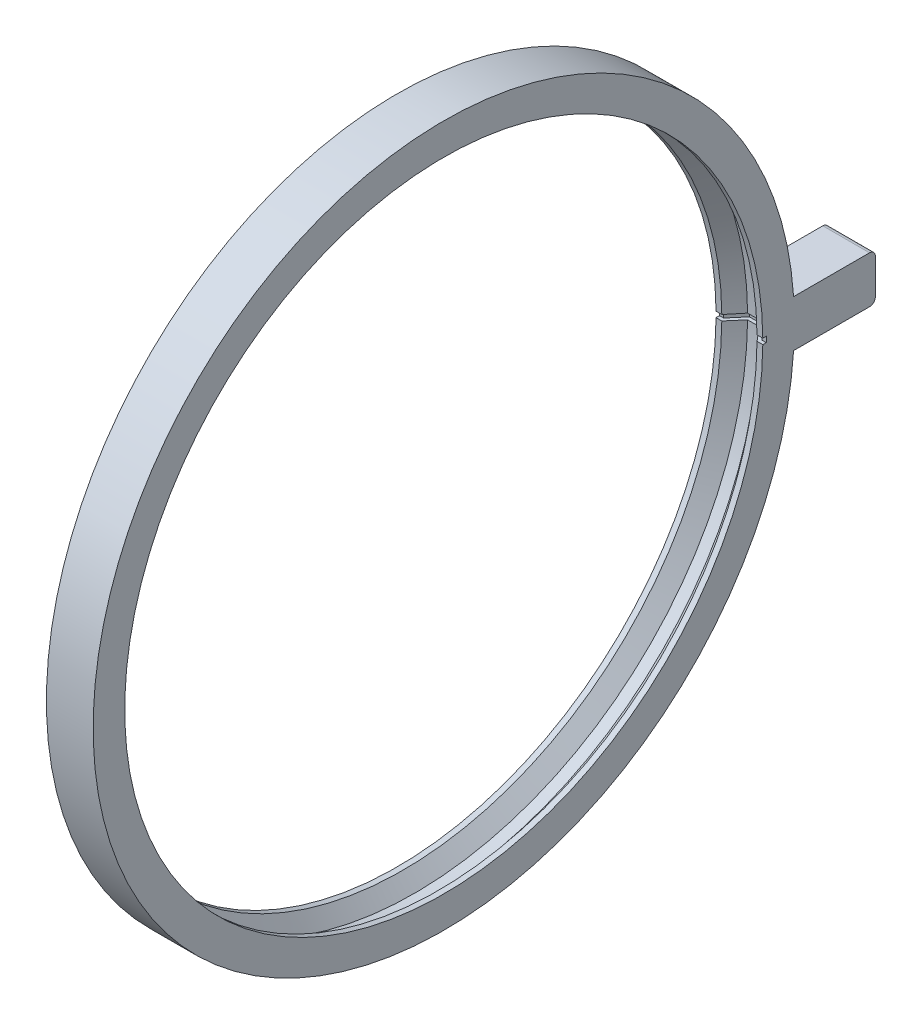
ISO-10303-21;
HEADER;
FILE_DESCRIPTION(('STEP AP214'),'2;1');
FILE_NAME('part.step','',(''),(''),'','','');
FILE_SCHEMA(('AUTOMOTIVE_DESIGN { 1 0 10303 214 1 1 1 1 }'));
ENDSEC;
DATA;
#1=APPLICATION_CONTEXT('core data for automotive mechanical design processes');
#2=APPLICATION_PROTOCOL_DEFINITION('international standard','automotive_design',2000,#1);
#3=PRODUCT_CONTEXT('',#1,'mechanical');
#4=PRODUCT('Part','Part','',(#3));
#5=PRODUCT_RELATED_PRODUCT_CATEGORY('part','',(#4));
#6=PRODUCT_DEFINITION_FORMATION('','',#4);
#7=PRODUCT_DEFINITION_CONTEXT('part definition',#1,'design');
#8=PRODUCT_DEFINITION('design','',#6,#7);
#9=PRODUCT_DEFINITION_SHAPE('','',#8);
#10=(LENGTH_UNIT() NAMED_UNIT(*) SI_UNIT(.MILLI.,.METRE.));
#11=(NAMED_UNIT(*) PLANE_ANGLE_UNIT() SI_UNIT($,.RADIAN.));
#12=(NAMED_UNIT(*) SI_UNIT($,.STERADIAN.) SOLID_ANGLE_UNIT());
#13=UNCERTAINTY_MEASURE_WITH_UNIT(LENGTH_MEASURE(1.E-05),#10,'distance_accuracy_value','');
#14=(GEOMETRIC_REPRESENTATION_CONTEXT(3) GLOBAL_UNCERTAINTY_ASSIGNED_CONTEXT((#13)) GLOBAL_UNIT_ASSIGNED_CONTEXT((#10,
#11,#12)) REPRESENTATION_CONTEXT('',''));
#15=CARTESIAN_POINT('',(0.,0.,0.));
#16=DIRECTION('',(0.,0.,1.));
#17=DIRECTION('',(1.,0.,0.));
#18=AXIS2_PLACEMENT_3D('',#15,#16,#17);
#19=CARTESIAN_POINT('',(0.,0.,0.));
#20=DIRECTION('',(-1.,0.,0.));
#21=DIRECTION('',(0.,0.,1.));
#22=AXIS2_PLACEMENT_3D('',#19,#20,#21);
#23=CYLINDRICAL_SURFACE('',#22,30.);
#24=DIRECTION('',(-1.,0.,0.));
#25=VECTOR('',#24,1.);
#26=CARTESIAN_POINT('',(2.,2.,-29.9332590941915));
#27=LINE('',#26,#25);
#28=CARTESIAN_POINT('',(2.,2.,-29.9332590941915));
#29=VERTEX_POINT('',#28);
#30=CARTESIAN_POINT('',(-2.,2.,-29.9332590941915));
#31=VERTEX_POINT('',#30);
#32=EDGE_CURVE('E258',#29,#31,#27,.T.);
#33=ORIENTED_EDGE('',*,*,#32,.T.);
#34=CARTESIAN_POINT('',(-2.,0.,0.));
#35=DIRECTION('',(-1.,0.,0.));
#36=DIRECTION('',(0.,0.,1.));
#37=AXIS2_PLACEMENT_3D('',#34,#35,#36);
#38=CIRCLE('',#37,30.);
#39=CARTESIAN_POINT('',(-2.,-2.,-29.9332590941915));
#40=VERTEX_POINT('',#39);
#41=EDGE_CURVE('E281',#40,#31,#38,.T.);
#42=ORIENTED_EDGE('',*,*,#41,.F.);
#43=DIRECTION('',(-1.,0.,0.));
#44=VECTOR('',#43,1.);
#45=CARTESIAN_POINT('',(2.,-2.,-29.9332590941915));
#46=LINE('',#45,#44);
#47=CARTESIAN_POINT('',(2.,-2.,-29.9332590941915));
#48=VERTEX_POINT('',#47);
#49=EDGE_CURVE('E250',#48,#40,#46,.T.);
#50=ORIENTED_EDGE('',*,*,#49,.F.);
#51=CARTESIAN_POINT('',(2.,0.,0.));
#52=DIRECTION('',(-1.,0.,0.));
#53=DIRECTION('',(0.,0.,1.));
#54=AXIS2_PLACEMENT_3D('',#51,#52,#53);
#55=CIRCLE('',#54,30.);
#56=EDGE_CURVE('E264',#48,#29,#55,.T.);
#57=ORIENTED_EDGE('',*,*,#56,.T.);
#58=EDGE_LOOP('',(#33,#42,#50,#57));
#59=FACE_BOUND('',#58,.T.);
#60=ADVANCED_FACE('F43',(#59),#23,.T.);
#61=CARTESIAN_POINT('',(0.,0.,0.));
#62=DIRECTION('',(-1.,0.,0.));
#63=DIRECTION('',(0.,0.,1.));
#64=AXIS2_PLACEMENT_3D('',#61,#62,#63);
#65=CYLINDRICAL_SURFACE('',#64,28.5);
#66=DIRECTION('',(1.,0.,0.));
#67=VECTOR('',#66,1.);
#68=CARTESIAN_POINT('',(-0.5,0.248706261703658,-28.4989148073289));
#69=LINE('',#68,#67);
#70=CARTESIAN_POINT('',(-0.5,0.248706261703658,-28.4989148073289));
#71=VERTEX_POINT('',#70);
#72=CARTESIAN_POINT('',(0.5,0.248706261703658,-28.4989148073289));
#73=VERTEX_POINT('',#72);
#74=EDGE_CURVE('E228',#71,#73,#69,.T.);
#75=ORIENTED_EDGE('',*,*,#74,.T.);
#76=CARTESIAN_POINT('',(0.499999999999997,0.,0.));
#77=DIRECTION('',(-1.,0.,0.));
#78=DIRECTION('',(0.,0.,1.));
#79=AXIS2_PLACEMENT_3D('',#76,#77,#78);
#80=CIRCLE('',#79,28.5);
#81=CARTESIAN_POINT('',(0.5,-0.248706261703658,-28.4989148073289));
#82=VERTEX_POINT('',#81);
#83=EDGE_CURVE('E261',#82,#73,#80,.T.);
#84=ORIENTED_EDGE('',*,*,#83,.F.);
#85=DIRECTION('',(1.,0.,0.));
#86=VECTOR('',#85,1.);
#87=CARTESIAN_POINT('',(-0.5,-0.248706261703658,-28.4989148073289));
#88=LINE('',#87,#86);
#89=CARTESIAN_POINT('',(-0.5,-0.248706261703658,-28.4989148073289));
#90=VERTEX_POINT('',#89);
#91=EDGE_CURVE('E209',#90,#82,#88,.T.);
#92=ORIENTED_EDGE('',*,*,#91,.F.);
#93=CARTESIAN_POINT('',(-0.499999999999997,0.,0.));
#94=DIRECTION('',(-1.,0.,0.));
#95=DIRECTION('',(0.,0.,1.));
#96=AXIS2_PLACEMENT_3D('',#93,#94,#95);
#97=CIRCLE('',#96,28.5);
#98=EDGE_CURVE('E272',#90,#71,#97,.T.);
#99=ORIENTED_EDGE('',*,*,#98,.T.);
#100=EDGE_LOOP('',(#75,#84,#92,#99));
#101=FACE_BOUND('',#100,.T.);
#102=ADVANCED_FACE('F324',(#101),#65,.F.);
#103=CARTESIAN_POINT('',(-2.,0.,0.));
#104=DIRECTION('',(1.,0.,0.));
#105=DIRECTION('',(0.,0.,-1.));
#106=AXIS2_PLACEMENT_3D('',#103,#104,#105);
#107=PLANE('',#106);
#108=DIRECTION('',(0.,1.,0.));
#109=VECTOR('',#108,1.);
#110=CARTESIAN_POINT('',(-2.,-2.,-36.9332590941915));
#111=LINE('',#110,#109);
#112=CARTESIAN_POINT('',(-2.,-1.5,-36.9332590941915));
#113=VERTEX_POINT('',#112);
#114=CARTESIAN_POINT('',(-2.,1.5,-36.9332590941915));
#115=VERTEX_POINT('',#114);
#116=EDGE_CURVE('E246',#113,#115,#111,.T.);
#117=ORIENTED_EDGE('',*,*,#116,.F.);
#118=CARTESIAN_POINT('',(-2.,-1.5,-36.4332590941915));
#119=DIRECTION('',(1.,0.,0.));
#120=DIRECTION('',(0.,0.,-1.));
#121=AXIS2_PLACEMENT_3D('',#118,#119,#120);
#122=CIRCLE('',#121,0.5);
#123=CARTESIAN_POINT('',(-2.,-2.,-36.4332590941915));
#124=VERTEX_POINT('',#123);
#125=EDGE_CURVE('E291',#113,#124,#122,.F.);
#126=ORIENTED_EDGE('',*,*,#125,.T.);
#127=DIRECTION('',(0.,0.,-1.));
#128=VECTOR('',#127,1.);
#129=CARTESIAN_POINT('',(-2.,-2.,-29.9332590941915));
#130=LINE('',#129,#128);
#131=EDGE_CURVE('E252',#40,#124,#130,.T.);
#132=ORIENTED_EDGE('',*,*,#131,.F.);
#133=ORIENTED_EDGE('',*,*,#41,.T.);
#134=DIRECTION('',(0.,0.,1.));
#135=VECTOR('',#134,1.);
#136=CARTESIAN_POINT('',(-2.,2.,-36.9332590941915));
#137=LINE('',#136,#135);
#138=CARTESIAN_POINT('',(-2.,2.,-36.4332590941915));
#139=VERTEX_POINT('',#138);
#140=EDGE_CURVE('E242',#139,#31,#137,.T.);
#141=ORIENTED_EDGE('',*,*,#140,.F.);
#142=CARTESIAN_POINT('',(-2.,1.5,-36.4332590941915));
#143=DIRECTION('',(1.,0.,0.));
#144=DIRECTION('',(0.,0.,-1.));
#145=AXIS2_PLACEMENT_3D('',#142,#143,#144);
#146=CIRCLE('',#145,0.5);
#147=EDGE_CURVE('E289',#139,#115,#146,.F.);
#148=ORIENTED_EDGE('',*,*,#147,.T.);
#149=EDGE_LOOP('',(#117,#126,#132,#133,#141,#148));
#150=FACE_BOUND('',#149,.T.);
#151=CARTESIAN_POINT('',(-2.,0.,0.));
#152=DIRECTION('',(-1.,0.,0.));
#153=DIRECTION('',(0.,0.,1.));
#154=AXIS2_PLACEMENT_3D('',#151,#152,#153);
#155=CIRCLE('',#154,27.6);
#156=CARTESIAN_POINT('',(-2.,0.240852379755121,-27.5989490765711));
#157=VERTEX_POINT('',#156);
#158=CARTESIAN_POINT('',(-2.,-0.240852379755121,-27.5989490765711));
#159=VERTEX_POINT('',#158);
#160=EDGE_CURVE('E240',#157,#159,#155,.T.);
#161=ORIENTED_EDGE('',*,*,#160,.F.);
#162=DIRECTION('',(0.,-0.00872653549837396,0.999961923064171));
#163=VECTOR('',#162,1.);
#164=CARTESIAN_POINT('',(-2.,0.240852379755121,-27.5989490765711));
#165=LINE('',#164,#163);
#166=CARTESIAN_POINT('',(-2.,0.238234419105609,-27.2989604996519));
#167=VERTEX_POINT('',#166);
#168=EDGE_CURVE('E219',#157,#167,#165,.T.);
#169=ORIENTED_EDGE('',*,*,#168,.T.);
#170=CARTESIAN_POINT('',(-2.,0.,0.));
#171=DIRECTION('',(-1.,0.,0.));
#172=DIRECTION('',(0.,0.,1.));
#173=AXIS2_PLACEMENT_3D('',#170,#171,#172);
#174=CIRCLE('',#173,27.3);
#175=CARTESIAN_POINT('',(-2.,-0.238234419105609,-27.2989604996519));
#176=VERTEX_POINT('',#175);
#177=EDGE_CURVE('E278',#176,#167,#174,.T.);
#178=ORIENTED_EDGE('',*,*,#177,.F.);
#179=DIRECTION('',(0.,0.00872653549837395,0.999961923064171));
#180=VECTOR('',#179,1.);
#181=CARTESIAN_POINT('',(-2.,-0.240852379755121,-27.5989490765711));
#182=LINE('',#181,#180);
#183=EDGE_CURVE('E198',#159,#176,#182,.T.);
#184=ORIENTED_EDGE('',*,*,#183,.F.);
#185=EDGE_LOOP('',(#161,#169,#178,#184));
#186=FACE_BOUND('',#185,.T.);
#187=ADVANCED_FACE('F305',(#150,#186),#107,.F.);
#188=CARTESIAN_POINT('',(0.,0.,0.));
#189=DIRECTION('',(-1.,0.,0.));
#190=DIRECTION('',(0.,0.,1.));
#191=AXIS2_PLACEMENT_3D('',#188,#189,#190);
#192=CYLINDRICAL_SURFACE('',#191,27.3);
#193=ORIENTED_EDGE('',*,*,#177,.T.);
#194=DIRECTION('',(1.,0.,0.));
#195=VECTOR('',#194,1.);
#196=CARTESIAN_POINT('',(-2.,0.238234419105609,-27.2989604996519));
#197=LINE('',#196,#195);
#198=CARTESIAN_POINT('',(-1.50691955741273,0.238234419105609,-27.2989604996519));
#199=VERTEX_POINT('',#198);
#200=EDGE_CURVE('E222',#167,#199,#197,.T.);
#201=ORIENTED_EDGE('',*,*,#200,.T.);
#202=CARTESIAN_POINT('',(-1.50691955741273,0.,0.));
#203=DIRECTION('',(-1.,0.,0.));
#204=DIRECTION('',(0.,0.,1.));
#205=AXIS2_PLACEMENT_3D('',#202,#203,#204);
#206=CIRCLE('',#205,27.3);
#207=CARTESIAN_POINT('',(-1.50691955741273,-0.238234419105609,-27.2989604996519));
#208=VERTEX_POINT('',#207);
#209=EDGE_CURVE('E275',#208,#199,#206,.T.);
#210=ORIENTED_EDGE('',*,*,#209,.F.);
#211=DIRECTION('',(1.,0.,0.));
#212=VECTOR('',#211,1.);
#213=CARTESIAN_POINT('',(-2.,-0.238234419105609,-27.2989604996519));
#214=LINE('',#213,#212);
#215=EDGE_CURVE('E205',#176,#208,#214,.T.);
#216=ORIENTED_EDGE('',*,*,#215,.F.);
#217=EDGE_LOOP('',(#193,#201,#210,#216));
#218=FACE_BOUND('',#217,.T.);
#219=ADVANCED_FACE('F335',(#218),#192,.F.);
#220=CARTESIAN_POINT('',(-1.50691955741273,0.,0.));
#221=DIRECTION('',(1.,0.,0.));
#222=DIRECTION('',(0.,0.,-1.));
#223=AXIS2_PLACEMENT_3D('',#220,#221,#222);
#224=CONICAL_SURFACE('',#223,27.3,0.872664625997165);
#225=ORIENTED_EDGE('',*,*,#209,.T.);
#226=DIRECTION('',(0.642787609686538,0.00668491402620988,-0.766015274493877));
#227=VECTOR('',#226,1.);
#228=CARTESIAN_POINT('',(-1.50691955741273,0.238234419105609,-27.2989604996519));
#229=LINE('',#228,#227);
#230=EDGE_CURVE('E225',#199,#71,#229,.T.);
#231=ORIENTED_EDGE('',*,*,#230,.T.);
#232=ORIENTED_EDGE('',*,*,#98,.F.);
#233=DIRECTION('',(0.642787609686538,-0.00668491402620988,-0.766015274493877));
#234=VECTOR('',#233,1.);
#235=CARTESIAN_POINT('',(-1.50691955741273,-0.238234419105609,-27.2989604996519));
#236=LINE('',#235,#234);
#237=EDGE_CURVE('E207',#208,#90,#236,.T.);
#238=ORIENTED_EDGE('',*,*,#237,.F.);
#239=EDGE_LOOP('',(#225,#231,#232,#238));
#240=FACE_BOUND('',#239,.T.);
#241=ADVANCED_FACE('F338',(#240),#224,.F.);
#242=CARTESIAN_POINT('',(2.,0.,0.));
#243=DIRECTION('',(-1.,0.,0.));
#244=DIRECTION('',(0.,0.,-1.));
#245=AXIS2_PLACEMENT_3D('',#242,#243,#244);
#246=PLANE('',#245);
#247=DIRECTION('',(0.,0.,-1.));
#248=VECTOR('',#247,1.);
#249=CARTESIAN_POINT('',(2.,-2.,-29.9332590941915));
#250=LINE('',#249,#248);
#251=CARTESIAN_POINT('',(2.,-2.,-36.4332590941915));
#252=VERTEX_POINT('',#251);
#253=EDGE_CURVE('E245',#48,#252,#250,.T.);
#254=ORIENTED_EDGE('',*,*,#253,.T.);
#255=CARTESIAN_POINT('',(2.,-1.5,-36.4332590941915));
#256=DIRECTION('',(-1.,0.,0.));
#257=DIRECTION('',(0.,0.,1.));
#258=AXIS2_PLACEMENT_3D('',#255,#256,#257);
#259=CIRCLE('',#258,0.5);
#260=CARTESIAN_POINT('',(2.,-1.5,-36.9332590941915));
#261=VERTEX_POINT('',#260);
#262=EDGE_CURVE('E51',#252,#261,#259,.F.);
#263=ORIENTED_EDGE('',*,*,#262,.T.);
#264=DIRECTION('',(0.,1.,0.));
#265=VECTOR('',#264,1.);
#266=CARTESIAN_POINT('',(2.,-2.,-36.9332590941915));
#267=LINE('',#266,#265);
#268=CARTESIAN_POINT('',(2.,1.5,-36.9332590941915));
#269=VERTEX_POINT('',#268);
#270=EDGE_CURVE('E248',#261,#269,#267,.T.);
#271=ORIENTED_EDGE('',*,*,#270,.T.);
#272=CARTESIAN_POINT('',(2.,1.5,-36.4332590941915));
#273=DIRECTION('',(-1.,0.,0.));
#274=DIRECTION('',(0.,0.,1.));
#275=AXIS2_PLACEMENT_3D('',#272,#273,#274);
#276=CIRCLE('',#275,0.5);
#277=CARTESIAN_POINT('',(2.,2.,-36.4332590941915));
#278=VERTEX_POINT('',#277);
#279=EDGE_CURVE('E58',#269,#278,#276,.F.);
#280=ORIENTED_EDGE('',*,*,#279,.T.);
#281=DIRECTION('',(0.,0.,1.));
#282=VECTOR('',#281,1.);
#283=CARTESIAN_POINT('',(2.,2.,-36.9332590941915));
#284=LINE('',#283,#282);
#285=EDGE_CURVE('E243',#278,#29,#284,.T.);
#286=ORIENTED_EDGE('',*,*,#285,.T.);
#287=ORIENTED_EDGE('',*,*,#56,.F.);
#288=EDGE_LOOP('',(#254,#263,#271,#280,#286,#287));
#289=FACE_BOUND('',#288,.T.);
#290=CARTESIAN_POINT('',(2.,0.,0.));
#291=DIRECTION('',(-1.,0.,0.));
#292=DIRECTION('',(0.,0.,1.));
#293=AXIS2_PLACEMENT_3D('',#290,#291,#292);
#294=CIRCLE('',#293,27.3);
#295=CARTESIAN_POINT('',(2.,-0.238234419105609,-27.2989604996519));
#296=VERTEX_POINT('',#295);
#297=CARTESIAN_POINT('',(2.,0.238234419105609,-27.2989604996519));
#298=VERTEX_POINT('',#297);
#299=EDGE_CURVE('E267',#296,#298,#294,.T.);
#300=ORIENTED_EDGE('',*,*,#299,.T.);
#301=DIRECTION('',(0.,-0.00872653549837396,0.999961923064171));
#302=VECTOR('',#301,1.);
#303=CARTESIAN_POINT('',(2.,0.240852379755121,-27.5989490765711));
#304=LINE('',#303,#302);
#305=CARTESIAN_POINT('',(2.,0.240852379755121,-27.5989490765711));
#306=VERTEX_POINT('',#305);
#307=EDGE_CURVE('E194',#306,#298,#304,.T.);
#308=ORIENTED_EDGE('',*,*,#307,.F.);
#309=CARTESIAN_POINT('',(2.,0.,0.));
#310=DIRECTION('',(-1.,0.,0.));
#311=DIRECTION('',(0.,0.,1.));
#312=AXIS2_PLACEMENT_3D('',#309,#310,#311);
#313=CIRCLE('',#312,27.6);
#314=CARTESIAN_POINT('',(2.,-0.240852379755121,-27.5989490765711));
#315=VERTEX_POINT('',#314);
#316=EDGE_CURVE('E188',#306,#315,#313,.T.);
#317=ORIENTED_EDGE('',*,*,#316,.T.);
#318=DIRECTION('',(0.,0.00872653549837395,0.999961923064171));
#319=VECTOR('',#318,1.);
#320=CARTESIAN_POINT('',(2.,-0.240852379755121,-27.5989490765711));
#321=LINE('',#320,#319);
#322=EDGE_CURVE('E170',#315,#296,#321,.T.);
#323=ORIENTED_EDGE('',*,*,#322,.T.);
#324=EDGE_LOOP('',(#300,#308,#317,#323));
#325=FACE_BOUND('',#324,.T.);
#326=ADVANCED_FACE('F193',(#289,#325),#246,.F.);
#327=CARTESIAN_POINT('',(0.,0.,0.));
#328=DIRECTION('',(1.,0.,0.));
#329=DIRECTION('',(0.,0.,1.));
#330=AXIS2_PLACEMENT_3D('',#327,#328,#329);
#331=CYLINDRICAL_SURFACE('',#330,27.3);
#332=CARTESIAN_POINT('',(1.50691955741273,0.,0.));
#333=DIRECTION('',(-1.,0.,0.));
#334=DIRECTION('',(0.,0.,1.));
#335=AXIS2_PLACEMENT_3D('',#332,#333,#334);
#336=CIRCLE('',#335,27.3);
#337=CARTESIAN_POINT('',(1.50691955741273,-0.238234419105609,-27.2989604996519));
#338=VERTEX_POINT('',#337);
#339=CARTESIAN_POINT('',(1.50691955741273,0.238234419105609,-27.2989604996519));
#340=VERTEX_POINT('',#339);
#341=EDGE_CURVE('E269',#338,#340,#336,.T.);
#342=ORIENTED_EDGE('',*,*,#341,.T.);
#343=DIRECTION('',(-1.,0.,0.));
#344=VECTOR('',#343,1.);
#345=CARTESIAN_POINT('',(2.,0.238234419105609,-27.2989604996519));
#346=LINE('',#345,#344);
#347=EDGE_CURVE('E527',#298,#340,#346,.T.);
#348=ORIENTED_EDGE('',*,*,#347,.F.);
#349=ORIENTED_EDGE('',*,*,#299,.F.);
#350=DIRECTION('',(-1.,0.,0.));
#351=VECTOR('',#350,1.);
#352=CARTESIAN_POINT('',(2.,-0.238234419105609,-27.2989604996519));
#353=LINE('',#352,#351);
#354=EDGE_CURVE('E177',#296,#338,#353,.T.);
#355=ORIENTED_EDGE('',*,*,#354,.T.);
#356=EDGE_LOOP('',(#342,#348,#349,#355));
#357=FACE_BOUND('',#356,.T.);
#358=ADVANCED_FACE('F346',(#357),#331,.F.);
#359=CARTESIAN_POINT('',(1.50691955741273,0.,0.));
#360=DIRECTION('',(-1.,0.,0.));
#361=DIRECTION('',(0.,0.,-1.));
#362=AXIS2_PLACEMENT_3D('',#359,#360,#361);
#363=CONICAL_SURFACE('',#362,27.3,0.872664625997165);
#364=ORIENTED_EDGE('',*,*,#83,.T.);
#365=DIRECTION('',(-0.642787609686538,0.00668491402620988,-0.766015274493877));
#366=VECTOR('',#365,1.);
#367=CARTESIAN_POINT('',(1.50691955741273,0.238234419105609,-27.2989604996519));
#368=LINE('',#367,#366);
#369=EDGE_CURVE('E513',#340,#73,#368,.T.);
#370=ORIENTED_EDGE('',*,*,#369,.F.);
#371=ORIENTED_EDGE('',*,*,#341,.F.);
#372=DIRECTION('',(-0.642787609686538,-0.00668491402620988,-0.766015274493877));
#373=VECTOR('',#372,1.);
#374=CARTESIAN_POINT('',(1.50691955741273,-0.238234419105609,-27.2989604996519));
#375=LINE('',#374,#373);
#376=EDGE_CURVE('E519',#338,#82,#375,.T.);
#377=ORIENTED_EDGE('',*,*,#376,.T.);
#378=EDGE_LOOP('',(#364,#370,#371,#377));
#379=FACE_BOUND('',#378,.T.);
#380=ADVANCED_FACE('F343',(#379),#363,.F.);
#381=CARTESIAN_POINT('',(2.,2.,-36.9332590941915));
#382=DIRECTION('',(0.,-1.,0.));
#383=DIRECTION('',(0.,0.,-1.));
#384=AXIS2_PLACEMENT_3D('',#381,#382,#383);
#385=PLANE('',#384);
#386=ORIENTED_EDGE('',*,*,#285,.F.);
#387=DIRECTION('',(-1.,0.,0.));
#388=VECTOR('',#387,1.);
#389=CARTESIAN_POINT('',(2.,2.,-36.4332590941915));
#390=LINE('',#389,#388);
#391=EDGE_CURVE('E11',#278,#139,#390,.T.);
#392=ORIENTED_EDGE('',*,*,#391,.T.);
#393=ORIENTED_EDGE('',*,*,#140,.T.);
#394=ORIENTED_EDGE('',*,*,#32,.F.);
#395=EDGE_LOOP('',(#386,#392,#393,#394));
#396=FACE_BOUND('',#395,.T.);
#397=ADVANCED_FACE('F314',(#396),#385,.F.);
#398=CARTESIAN_POINT('',(2.,-2.,-29.9332590941915));
#399=DIRECTION('',(0.,1.,0.));
#400=DIRECTION('',(0.,0.,1.));
#401=AXIS2_PLACEMENT_3D('',#398,#399,#400);
#402=PLANE('',#401);
#403=ORIENTED_EDGE('',*,*,#131,.T.);
#404=DIRECTION('',(-1.,0.,0.));
#405=VECTOR('',#404,1.);
#406=CARTESIAN_POINT('',(2.,-2.,-36.4332590941915));
#407=LINE('',#406,#405);
#408=EDGE_CURVE('E66',#124,#252,#407,.F.);
#409=ORIENTED_EDGE('',*,*,#408,.T.);
#410=ORIENTED_EDGE('',*,*,#253,.F.);
#411=ORIENTED_EDGE('',*,*,#49,.T.);
#412=EDGE_LOOP('',(#403,#409,#410,#411));
#413=FACE_BOUND('',#412,.T.);
#414=ADVANCED_FACE('F307',(#413),#402,.F.);
#415=CARTESIAN_POINT('',(2.,-2.,-36.9332590941915));
#416=DIRECTION('',(0.,0.,1.));
#417=DIRECTION('',(1.,0.,0.));
#418=AXIS2_PLACEMENT_3D('',#415,#416,#417);
#419=PLANE('',#418);
#420=ORIENTED_EDGE('',*,*,#270,.F.);
#421=DIRECTION('',(-1.,0.,0.));
#422=VECTOR('',#421,1.);
#423=CARTESIAN_POINT('',(2.,-1.5,-36.9332590941915));
#424=LINE('',#423,#422);
#425=EDGE_CURVE('E286',#261,#113,#424,.T.);
#426=ORIENTED_EDGE('',*,*,#425,.T.);
#427=ORIENTED_EDGE('',*,*,#116,.T.);
#428=DIRECTION('',(-1.,0.,0.));
#429=VECTOR('',#428,1.);
#430=CARTESIAN_POINT('',(2.,1.5,-36.9332590941915));
#431=LINE('',#430,#429);
#432=EDGE_CURVE('E284',#115,#269,#431,.F.);
#433=ORIENTED_EDGE('',*,*,#432,.T.);
#434=EDGE_LOOP('',(#420,#426,#427,#433));
#435=FACE_BOUND('',#434,.T.);
#436=ADVANCED_FACE('F300',(#435),#419,.F.);
#437=CARTESIAN_POINT('',(0.,0.,0.));
#438=DIRECTION('',(-1.,0.,0.));
#439=DIRECTION('',(0.,0.,1.));
#440=AXIS2_PLACEMENT_3D('',#437,#438,#439);
#441=CYLINDRICAL_SURFACE('',#440,27.6);
#442=ORIENTED_EDGE('',*,*,#160,.T.);
#443=DIRECTION('',(-1.,0.,0.));
#444=VECTOR('',#443,1.);
#445=CARTESIAN_POINT('',(-1.64681185485923,-0.240852379755121,-27.5989490765711));
#446=LINE('',#445,#444);
#447=CARTESIAN_POINT('',(-1.64681185485923,-0.240852379755121,-27.5989490765711));
#448=VERTEX_POINT('',#447);
#449=EDGE_CURVE('E195',#448,#159,#446,.T.);
#450=ORIENTED_EDGE('',*,*,#449,.F.);
#451=CARTESIAN_POINT('',(-1.64681185485923,0.,0.));
#452=DIRECTION('',(-1.,0.,0.));
#453=DIRECTION('',(0.,0.,1.));
#454=AXIS2_PLACEMENT_3D('',#451,#452,#453);
#455=CIRCLE('',#454,27.6);
#456=CARTESIAN_POINT('',(-1.64681185485923,0.240852379755121,-27.5989490765711));
#457=VERTEX_POINT('',#456);
#458=EDGE_CURVE('E236',#457,#448,#455,.T.);
#459=ORIENTED_EDGE('',*,*,#458,.F.);
#460=DIRECTION('',(-1.,0.,0.));
#461=VECTOR('',#460,1.);
#462=CARTESIAN_POINT('',(-1.64681185485923,0.240852379755121,-27.5989490765711));
#463=LINE('',#462,#461);
#464=EDGE_CURVE('E217',#457,#157,#463,.T.);
#465=ORIENTED_EDGE('',*,*,#464,.T.);
#466=EDGE_LOOP('',(#442,#450,#459,#465));
#467=FACE_BOUND('',#466,.T.);
#468=ADVANCED_FACE('F359',(#467),#441,.F.);
#469=CARTESIAN_POINT('',(0.,0.,0.));
#470=DIRECTION('',(-1.,0.,0.));
#471=DIRECTION('',(0.,0.,1.));
#472=AXIS2_PLACEMENT_3D('',#469,#470,#471);
#473=CYLINDRICAL_SURFACE('',#472,28.8);
#474=CARTESIAN_POINT('',(-0.639892297446499,0.,0.));
#475=DIRECTION('',(-1.,0.,0.));
#476=DIRECTION('',(0.,0.,1.));
#477=AXIS2_PLACEMENT_3D('',#474,#475,#476);
#478=CIRCLE('',#477,28.8);
#479=CARTESIAN_POINT('',(-0.639892297446499,0.25132422235317,-28.7989033842481));
#480=VERTEX_POINT('',#479);
#481=CARTESIAN_POINT('',(-0.639892297446499,-0.25132422235317,-28.7989033842481));
#482=VERTEX_POINT('',#481);
#483=EDGE_CURVE('E238',#480,#482,#478,.T.);
#484=ORIENTED_EDGE('',*,*,#483,.T.);
#485=DIRECTION('',(-1.,0.,0.));
#486=VECTOR('',#485,1.);
#487=CARTESIAN_POINT('',(0.,-0.25132422235317,-28.7989033842481));
#488=LINE('',#487,#486);
#489=CARTESIAN_POINT('',(0.639892297446499,-0.25132422235317,-28.7989033842481));
#490=VERTEX_POINT('',#489);
#491=EDGE_CURVE('E211',#490,#482,#488,.T.);
#492=ORIENTED_EDGE('',*,*,#491,.F.);
#493=CARTESIAN_POINT('',(0.639892297446499,0.,0.));
#494=DIRECTION('',(-1.,0.,0.));
#495=DIRECTION('',(0.,0.,1.));
#496=AXIS2_PLACEMENT_3D('',#493,#494,#495);
#497=CIRCLE('',#496,28.8);
#498=CARTESIAN_POINT('',(0.639892297446499,0.25132422235317,-28.7989033842481));
#499=VERTEX_POINT('',#498);
#500=EDGE_CURVE('E196',#499,#490,#497,.T.);
#501=ORIENTED_EDGE('',*,*,#500,.F.);
#502=DIRECTION('',(-1.,0.,0.));
#503=VECTOR('',#502,1.);
#504=CARTESIAN_POINT('',(0.,0.25132422235317,-28.7989033842481));
#505=LINE('',#504,#503);
#506=EDGE_CURVE('E230',#499,#480,#505,.T.);
#507=ORIENTED_EDGE('',*,*,#506,.T.);
#508=EDGE_LOOP('',(#484,#492,#501,#507));
#509=FACE_BOUND('',#508,.T.);
#510=ADVANCED_FACE('F360',(#509),#473,.F.);
#511=CARTESIAN_POINT('',(-0.639892297446499,0.,0.));
#512=DIRECTION('',(1.,0.,0.));
#513=DIRECTION('',(0.,0.,-1.));
#514=AXIS2_PLACEMENT_3D('',#511,#512,#513);
#515=CONICAL_SURFACE('',#514,28.8,0.872664625997168);
#516=DIRECTION('',(-0.642787609686538,-0.00668491402620988,0.766015274493877));
#517=VECTOR('',#516,1.);
#518=CARTESIAN_POINT('',(-0.639892297446499,0.25132422235317,-28.7989033842481));
#519=LINE('',#518,#517);
#520=EDGE_CURVE('E233',#480,#457,#519,.T.);
#521=ORIENTED_EDGE('',*,*,#520,.T.);
#522=ORIENTED_EDGE('',*,*,#458,.T.);
#523=DIRECTION('',(-0.642787609686538,0.00668491402620988,0.766015274493877));
#524=VECTOR('',#523,1.);
#525=CARTESIAN_POINT('',(-0.639892297446499,-0.25132422235317,-28.7989033842481));
#526=LINE('',#525,#524);
#527=EDGE_CURVE('E214',#482,#448,#526,.T.);
#528=ORIENTED_EDGE('',*,*,#527,.F.);
#529=ORIENTED_EDGE('',*,*,#483,.F.);
#530=EDGE_LOOP('',(#521,#522,#528,#529));
#531=FACE_BOUND('',#530,.T.);
#532=ADVANCED_FACE('F363',(#531),#515,.F.);
#533=CARTESIAN_POINT('',(0.,0.,0.));
#534=DIRECTION('',(0.,0.999961923064171,0.00872653549837396));
#535=DIRECTION('',(0.,-0.00872653549837396,0.999961923064171));
#536=AXIS2_PLACEMENT_3D('',#533,#534,#535);
#537=PLANE('',#536);
#538=ORIENTED_EDGE('',*,*,#464,.F.);
#539=ORIENTED_EDGE('',*,*,#520,.F.);
#540=ORIENTED_EDGE('',*,*,#506,.F.);
#541=DIRECTION('',(0.642787609686538,-0.00668491402620988,0.766015274493877));
#542=VECTOR('',#541,1.);
#543=CARTESIAN_POINT('',(0.639892297446499,0.25132422235317,-28.7989033842481));
#544=LINE('',#543,#542);
#545=CARTESIAN_POINT('',(1.64681185485923,0.240852379755121,-27.5989490765711));
#546=VERTEX_POINT('',#545);
#547=EDGE_CURVE('E511',#499,#546,#544,.T.);
#548=ORIENTED_EDGE('',*,*,#547,.T.);
#549=DIRECTION('',(1.,0.,0.));
#550=VECTOR('',#549,1.);
#551=CARTESIAN_POINT('',(1.64681185485923,0.240852379755121,-27.5989490765711));
#552=LINE('',#551,#550);
#553=EDGE_CURVE('E518',#546,#306,#552,.T.);
#554=ORIENTED_EDGE('',*,*,#553,.T.);
#555=ORIENTED_EDGE('',*,*,#307,.T.);
#556=ORIENTED_EDGE('',*,*,#347,.T.);
#557=ORIENTED_EDGE('',*,*,#369,.T.);
#558=ORIENTED_EDGE('',*,*,#74,.F.);
#559=ORIENTED_EDGE('',*,*,#230,.F.);
#560=ORIENTED_EDGE('',*,*,#200,.F.);
#561=ORIENTED_EDGE('',*,*,#168,.F.);
#562=EDGE_LOOP('',(#538,#539,#540,#548,#554,#555,#556,#557,#558,#559,#560,#561));
#563=FACE_BOUND('',#562,.T.);
#564=ADVANCED_FACE('F367',(#563),#537,.F.);
#565=CARTESIAN_POINT('',(0.,0.,0.));
#566=DIRECTION('',(0.,0.999961923064171,-0.00872653549837395));
#567=DIRECTION('',(0.,0.00872653549837395,0.999961923064171));
#568=AXIS2_PLACEMENT_3D('',#565,#566,#567);
#569=PLANE('',#568);
#570=ORIENTED_EDGE('',*,*,#449,.T.);
#571=ORIENTED_EDGE('',*,*,#183,.T.);
#572=ORIENTED_EDGE('',*,*,#215,.T.);
#573=ORIENTED_EDGE('',*,*,#237,.T.);
#574=ORIENTED_EDGE('',*,*,#91,.T.);
#575=ORIENTED_EDGE('',*,*,#376,.F.);
#576=ORIENTED_EDGE('',*,*,#354,.F.);
#577=ORIENTED_EDGE('',*,*,#322,.F.);
#578=DIRECTION('',(1.,0.,0.));
#579=VECTOR('',#578,1.);
#580=CARTESIAN_POINT('',(1.64681185485923,-0.240852379755121,-27.5989490765711));
#581=LINE('',#580,#579);
#582=CARTESIAN_POINT('',(1.64681185485923,-0.240852379755121,-27.5989490765711));
#583=VERTEX_POINT('',#582);
#584=EDGE_CURVE('E175',#583,#315,#581,.T.);
#585=ORIENTED_EDGE('',*,*,#584,.F.);
#586=DIRECTION('',(0.642787609686538,0.00668491402620988,0.766015274493877));
#587=VECTOR('',#586,1.);
#588=CARTESIAN_POINT('',(0.639892297446499,-0.25132422235317,-28.7989033842481));
#589=LINE('',#588,#587);
#590=EDGE_CURVE('E517',#490,#583,#589,.T.);
#591=ORIENTED_EDGE('',*,*,#590,.F.);
#592=ORIENTED_EDGE('',*,*,#491,.T.);
#593=ORIENTED_EDGE('',*,*,#527,.T.);
#594=EDGE_LOOP('',(#570,#571,#572,#573,#574,#575,#576,#577,#585,#591,#592,#593));
#595=FACE_BOUND('',#594,.T.);
#596=ADVANCED_FACE('F173',(#595),#569,.T.);
#597=CARTESIAN_POINT('',(0.,0.,0.));
#598=DIRECTION('',(1.,0.,0.));
#599=DIRECTION('',(0.,0.,1.));
#600=AXIS2_PLACEMENT_3D('',#597,#598,#599);
#601=CYLINDRICAL_SURFACE('',#600,27.6);
#602=ORIENTED_EDGE('',*,*,#316,.F.);
#603=ORIENTED_EDGE('',*,*,#553,.F.);
#604=CARTESIAN_POINT('',(1.64681185485923,0.,0.));
#605=DIRECTION('',(-1.,0.,0.));
#606=DIRECTION('',(0.,0.,1.));
#607=AXIS2_PLACEMENT_3D('',#604,#605,#606);
#608=CIRCLE('',#607,27.6);
#609=EDGE_CURVE('E191',#546,#583,#608,.T.);
#610=ORIENTED_EDGE('',*,*,#609,.T.);
#611=ORIENTED_EDGE('',*,*,#584,.T.);
#612=EDGE_LOOP('',(#602,#603,#610,#611));
#613=FACE_BOUND('',#612,.T.);
#614=ADVANCED_FACE('F186',(#613),#601,.F.);
#615=CARTESIAN_POINT('',(0.639892297446499,0.,0.));
#616=DIRECTION('',(-1.,0.,0.));
#617=DIRECTION('',(0.,0.,-1.));
#618=AXIS2_PLACEMENT_3D('',#615,#616,#617);
#619=CONICAL_SURFACE('',#618,28.8,0.872664625997168);
#620=ORIENTED_EDGE('',*,*,#547,.F.);
#621=ORIENTED_EDGE('',*,*,#500,.T.);
#622=ORIENTED_EDGE('',*,*,#590,.T.);
#623=ORIENTED_EDGE('',*,*,#609,.F.);
#624=EDGE_LOOP('',(#620,#621,#622,#623));
#625=FACE_BOUND('',#624,.T.);
#626=ADVANCED_FACE('F322',(#625),#619,.F.);
#627=CARTESIAN_POINT('',(2.,-1.5,-36.4332590941915));
#628=DIRECTION('',(-1.,0.,0.));
#629=DIRECTION('',(0.,0.,1.));
#630=AXIS2_PLACEMENT_3D('',#627,#628,#629);
#631=CYLINDRICAL_SURFACE('',#630,0.5);
#632=ORIENTED_EDGE('',*,*,#262,.F.);
#633=ORIENTED_EDGE('',*,*,#408,.F.);
#634=ORIENTED_EDGE('',*,*,#125,.F.);
#635=ORIENTED_EDGE('',*,*,#425,.F.);
#636=EDGE_LOOP('',(#632,#633,#634,#635));
#637=FACE_BOUND('',#636,.T.);
#638=ADVANCED_FACE('F303',(#637),#631,.T.);
#639=CARTESIAN_POINT('',(2.,1.5,-36.4332590941915));
#640=DIRECTION('',(-1.,0.,0.));
#641=DIRECTION('',(0.,0.,1.));
#642=AXIS2_PLACEMENT_3D('',#639,#640,#641);
#643=CYLINDRICAL_SURFACE('',#642,0.5);
#644=ORIENTED_EDGE('',*,*,#279,.F.);
#645=ORIENTED_EDGE('',*,*,#432,.F.);
#646=ORIENTED_EDGE('',*,*,#147,.F.);
#647=ORIENTED_EDGE('',*,*,#391,.F.);
#648=EDGE_LOOP('',(#644,#645,#646,#647));
#649=FACE_BOUND('',#648,.T.);
#650=ADVANCED_FACE('F45',(#649),#643,.T.);
#651=CLOSED_SHELL('',(#60,#102,#187,#219,#241,#326,#358,#380,#397,#414,#436,#468,#510,#532,#564,
#596,#614,#626,#638,#650));
#652=MANIFOLD_SOLID_BREP('B2',#651);
#653=ADVANCED_BREP_SHAPE_REPRESENTATION('',(#18,#652),#14);
#654=SHAPE_DEFINITION_REPRESENTATION(#9,#653);
ENDSEC;
END-ISO-10303-21;
